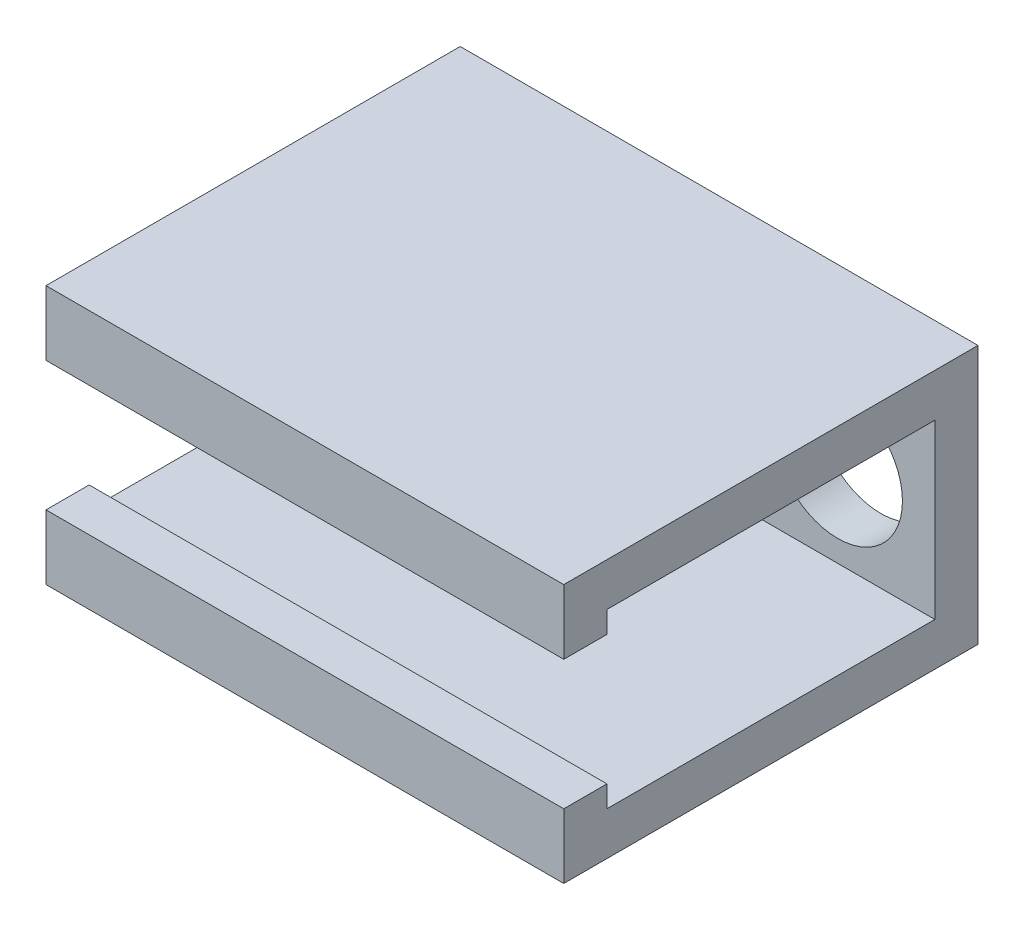
ISO-10303-21;
HEADER;
FILE_DESCRIPTION(('STEP AP214'),'2;1');
FILE_NAME('part.step','',(''),(''),'','','');
FILE_SCHEMA(('AUTOMOTIVE_DESIGN { 1 0 10303 214 1 1 1 1 }'));
ENDSEC;
DATA;
#1=APPLICATION_CONTEXT('core data for automotive mechanical design processes');
#2=APPLICATION_PROTOCOL_DEFINITION('international standard','automotive_design',2000,#1);
#3=PRODUCT_CONTEXT('',#1,'mechanical');
#4=PRODUCT('Part','Part','',(#3));
#5=PRODUCT_RELATED_PRODUCT_CATEGORY('part','',(#4));
#6=PRODUCT_DEFINITION_FORMATION('','',#4);
#7=PRODUCT_DEFINITION_CONTEXT('part definition',#1,'design');
#8=PRODUCT_DEFINITION('design','',#6,#7);
#9=PRODUCT_DEFINITION_SHAPE('','',#8);
#10=(LENGTH_UNIT() NAMED_UNIT(*) SI_UNIT(.MILLI.,.METRE.));
#11=(NAMED_UNIT(*) PLANE_ANGLE_UNIT() SI_UNIT($,.RADIAN.));
#12=(NAMED_UNIT(*) SI_UNIT($,.STERADIAN.) SOLID_ANGLE_UNIT());
#13=UNCERTAINTY_MEASURE_WITH_UNIT(LENGTH_MEASURE(1.E-05),#10,'distance_accuracy_value','');
#14=(GEOMETRIC_REPRESENTATION_CONTEXT(3) GLOBAL_UNCERTAINTY_ASSIGNED_CONTEXT((#13)) GLOBAL_UNIT_ASSIGNED_CONTEXT((#10,
#11,#12)) REPRESENTATION_CONTEXT('',''));
#15=CARTESIAN_POINT('',(0.,0.,0.));
#16=DIRECTION('',(0.,0.,1.));
#17=DIRECTION('',(1.,0.,0.));
#18=AXIS2_PLACEMENT_3D('',#15,#16,#17);
#19=CARTESIAN_POINT('',(60.,0.,-38.));
#20=DIRECTION('',(0.,0.,1.));
#21=DIRECTION('',(1.,0.,0.));
#22=AXIS2_PLACEMENT_3D('',#19,#20,#21);
#23=PLANE('',#22);
#24=CARTESIAN_POINT('',(48.7436129037064,0.,-38.));
#25=DIRECTION('',(0.,0.,1.));
#26=DIRECTION('',(1.,0.,0.));
#27=AXIS2_PLACEMENT_3D('',#24,#25,#26);
#28=CIRCLE('',#27,7.5);
#29=CARTESIAN_POINT('',(56.2436129037064,0.,-38.));
#30=VERTEX_POINT('',#29);
#31=EDGE_CURVE('E157',#30,#30,#28,.T.);
#32=ORIENTED_EDGE('',*,*,#31,.F.);
#33=EDGE_LOOP('',(#32));
#34=FACE_BOUND('',#33,.T.);
#35=DIRECTION('',(0.,1.,0.));
#36=VECTOR('',#35,1.);
#37=CARTESIAN_POINT('',(0.,0.,-38.));
#38=LINE('',#37,#36);
#39=CARTESIAN_POINT('',(0.,-10.,-38.));
#40=VERTEX_POINT('',#39);
#41=CARTESIAN_POINT('',(0.,10.,-38.));
#42=VERTEX_POINT('',#41);
#43=EDGE_CURVE('E153',#40,#42,#38,.T.);
#44=ORIENTED_EDGE('',*,*,#43,.F.);
#45=DIRECTION('',(-1.,0.,0.));
#46=VECTOR('',#45,1.);
#47=CARTESIAN_POINT('',(60.,-10.,-38.));
#48=LINE('',#47,#46);
#49=CARTESIAN_POINT('',(60.,-10.,-38.));
#50=VERTEX_POINT('',#49);
#51=EDGE_CURVE('E11',#50,#40,#48,.T.);
#52=ORIENTED_EDGE('',*,*,#51,.F.);
#53=DIRECTION('',(0.,1.,0.));
#54=VECTOR('',#53,1.);
#55=CARTESIAN_POINT('',(60.,0.,-38.));
#56=LINE('',#55,#54);
#57=CARTESIAN_POINT('',(60.,10.,-38.));
#58=VERTEX_POINT('',#57);
#59=EDGE_CURVE('E184',#50,#58,#56,.T.);
#60=ORIENTED_EDGE('',*,*,#59,.T.);
#61=DIRECTION('',(-1.,0.,0.));
#62=VECTOR('',#61,1.);
#63=CARTESIAN_POINT('',(60.,10.,-38.));
#64=LINE('',#63,#62);
#65=EDGE_CURVE('E97',#58,#42,#64,.T.);
#66=ORIENTED_EDGE('',*,*,#65,.T.);
#67=EDGE_LOOP('',(#44,#52,#60,#66));
#68=FACE_BOUND('',#67,.T.);
#69=ADVANCED_FACE('F35',(#34,#68),#23,.T.);
#70=CARTESIAN_POINT('',(60.,-10.,0.));
#71=DIRECTION('',(0.,1.,0.));
#72=DIRECTION('',(0.,0.,1.));
#73=AXIS2_PLACEMENT_3D('',#70,#71,#72);
#74=PLANE('',#73);
#75=DIRECTION('',(0.,0.,-1.));
#76=VECTOR('',#75,1.);
#77=CARTESIAN_POINT('',(0.,-10.,0.));
#78=LINE('',#77,#76);
#79=CARTESIAN_POINT('',(0.,-10.,0.));
#80=VERTEX_POINT('',#79);
#81=EDGE_CURVE('E156',#80,#40,#78,.T.);
#82=ORIENTED_EDGE('',*,*,#81,.F.);
#83=DIRECTION('',(-1.,0.,0.));
#84=VECTOR('',#83,1.);
#85=CARTESIAN_POINT('',(60.,-10.,0.));
#86=LINE('',#85,#84);
#87=CARTESIAN_POINT('',(60.,-10.,0.));
#88=VERTEX_POINT('',#87);
#89=EDGE_CURVE('E43',#88,#80,#86,.T.);
#90=ORIENTED_EDGE('',*,*,#89,.F.);
#91=DIRECTION('',(0.,0.,-1.));
#92=VECTOR('',#91,1.);
#93=CARTESIAN_POINT('',(60.,-10.,0.));
#94=LINE('',#93,#92);
#95=EDGE_CURVE('E224',#88,#50,#94,.T.);
#96=ORIENTED_EDGE('',*,*,#95,.T.);
#97=ORIENTED_EDGE('',*,*,#51,.T.);
#98=EDGE_LOOP('',(#82,#90,#96,#97));
#99=FACE_BOUND('',#98,.T.);
#100=ADVANCED_FACE('F210',(#99),#74,.T.);
#101=CARTESIAN_POINT('',(60.,0.,0.));
#102=DIRECTION('',(0.,0.,-1.));
#103=DIRECTION('',(0.,1.,0.));
#104=AXIS2_PLACEMENT_3D('',#101,#102,#103);
#105=PLANE('',#104);
#106=DIRECTION('',(0.,-1.,0.));
#107=VECTOR('',#106,1.);
#108=CARTESIAN_POINT('',(0.,0.,0.));
#109=LINE('',#108,#107);
#110=CARTESIAN_POINT('',(0.,-7.5,0.));
#111=VERTEX_POINT('',#110);
#112=EDGE_CURVE('E160',#111,#80,#109,.T.);
#113=ORIENTED_EDGE('',*,*,#112,.F.);
#114=DIRECTION('',(-1.,0.,0.));
#115=VECTOR('',#114,1.);
#116=CARTESIAN_POINT('',(60.,-7.5,0.));
#117=LINE('',#116,#115);
#118=CARTESIAN_POINT('',(60.,-7.5,0.));
#119=VERTEX_POINT('',#118);
#120=EDGE_CURVE('E199',#119,#111,#117,.T.);
#121=ORIENTED_EDGE('',*,*,#120,.F.);
#122=DIRECTION('',(0.,-1.,0.));
#123=VECTOR('',#122,1.);
#124=CARTESIAN_POINT('',(60.,0.,0.));
#125=LINE('',#124,#123);
#126=EDGE_CURVE('E206',#119,#88,#125,.T.);
#127=ORIENTED_EDGE('',*,*,#126,.T.);
#128=ORIENTED_EDGE('',*,*,#89,.T.);
#129=EDGE_LOOP('',(#113,#121,#127,#128));
#130=FACE_BOUND('',#129,.T.);
#131=ADVANCED_FACE('F204',(#130),#105,.T.);
#132=CARTESIAN_POINT('',(60.,-7.5,0.));
#133=DIRECTION('',(0.,-1.,0.));
#134=DIRECTION('',(0.,0.,-1.));
#135=AXIS2_PLACEMENT_3D('',#132,#133,#134);
#136=PLANE('',#135);
#137=DIRECTION('',(0.,0.,1.));
#138=VECTOR('',#137,1.);
#139=CARTESIAN_POINT('',(0.,-7.5,0.));
#140=LINE('',#139,#138);
#141=CARTESIAN_POINT('',(0.,-7.5,5.));
#142=VERTEX_POINT('',#141);
#143=EDGE_CURVE('E163',#111,#142,#140,.T.);
#144=ORIENTED_EDGE('',*,*,#143,.T.);
#145=DIRECTION('',(-1.,0.,0.));
#146=VECTOR('',#145,1.);
#147=CARTESIAN_POINT('',(60.,-7.5,5.));
#148=LINE('',#147,#146);
#149=CARTESIAN_POINT('',(60.,-7.5,5.));
#150=VERTEX_POINT('',#149);
#151=EDGE_CURVE('E197',#150,#142,#148,.T.);
#152=ORIENTED_EDGE('',*,*,#151,.F.);
#153=DIRECTION('',(0.,0.,1.));
#154=VECTOR('',#153,1.);
#155=CARTESIAN_POINT('',(60.,-7.5,0.));
#156=LINE('',#155,#154);
#157=EDGE_CURVE('E221',#119,#150,#156,.T.);
#158=ORIENTED_EDGE('',*,*,#157,.F.);
#159=ORIENTED_EDGE('',*,*,#120,.T.);
#160=EDGE_LOOP('',(#144,#152,#158,#159));
#161=FACE_BOUND('',#160,.T.);
#162=ADVANCED_FACE('F218',(#161),#136,.F.);
#163=CARTESIAN_POINT('',(60.,0.,5.));
#164=DIRECTION('',(0.,0.,-1.));
#165=DIRECTION('',(-1.,0.,0.));
#166=AXIS2_PLACEMENT_3D('',#163,#164,#165);
#167=PLANE('',#166);
#168=DIRECTION('',(0.,-1.,0.));
#169=VECTOR('',#168,1.);
#170=CARTESIAN_POINT('',(0.,0.,5.));
#171=LINE('',#170,#169);
#172=CARTESIAN_POINT('',(0.,-15.,5.));
#173=VERTEX_POINT('',#172);
#174=EDGE_CURVE('E166',#142,#173,#171,.T.);
#175=ORIENTED_EDGE('',*,*,#174,.T.);
#176=DIRECTION('',(-1.,0.,0.));
#177=VECTOR('',#176,1.);
#178=CARTESIAN_POINT('',(60.,-15.,5.));
#179=LINE('',#178,#177);
#180=CARTESIAN_POINT('',(60.,-15.,5.));
#181=VERTEX_POINT('',#180);
#182=EDGE_CURVE('E194',#181,#173,#179,.T.);
#183=ORIENTED_EDGE('',*,*,#182,.F.);
#184=DIRECTION('',(0.,-1.,0.));
#185=VECTOR('',#184,1.);
#186=CARTESIAN_POINT('',(60.,0.,5.));
#187=LINE('',#186,#185);
#188=EDGE_CURVE('E222',#150,#181,#187,.T.);
#189=ORIENTED_EDGE('',*,*,#188,.F.);
#190=ORIENTED_EDGE('',*,*,#151,.T.);
#191=EDGE_LOOP('',(#175,#183,#189,#190));
#192=FACE_BOUND('',#191,.T.);
#193=ADVANCED_FACE('F265',(#192),#167,.F.);
#194=CARTESIAN_POINT('',(60.,-15.,0.));
#195=DIRECTION('',(0.,1.,0.));
#196=DIRECTION('',(0.,0.,1.));
#197=AXIS2_PLACEMENT_3D('',#194,#195,#196);
#198=PLANE('',#197);
#199=DIRECTION('',(0.,0.,-1.));
#200=VECTOR('',#199,1.);
#201=CARTESIAN_POINT('',(0.,-15.,0.));
#202=LINE('',#201,#200);
#203=CARTESIAN_POINT('',(0.,-15.,-43.));
#204=VERTEX_POINT('',#203);
#205=EDGE_CURVE('E168',#173,#204,#202,.T.);
#206=ORIENTED_EDGE('',*,*,#205,.T.);
#207=DIRECTION('',(-1.,0.,0.));
#208=VECTOR('',#207,1.);
#209=CARTESIAN_POINT('',(60.,-15.,-43.));
#210=LINE('',#209,#208);
#211=CARTESIAN_POINT('',(60.,-15.,-43.));
#212=VERTEX_POINT('',#211);
#213=EDGE_CURVE('E192',#212,#204,#210,.T.);
#214=ORIENTED_EDGE('',*,*,#213,.F.);
#215=DIRECTION('',(0.,0.,-1.));
#216=VECTOR('',#215,1.);
#217=CARTESIAN_POINT('',(60.,-15.,0.));
#218=LINE('',#217,#216);
#219=EDGE_CURVE('E230',#181,#212,#218,.T.);
#220=ORIENTED_EDGE('',*,*,#219,.F.);
#221=ORIENTED_EDGE('',*,*,#182,.T.);
#222=EDGE_LOOP('',(#206,#214,#220,#221));
#223=FACE_BOUND('',#222,.T.);
#224=ADVANCED_FACE('F258',(#223),#198,.F.);
#225=CARTESIAN_POINT('',(60.,0.,-43.));
#226=DIRECTION('',(0.,0.,-1.));
#227=DIRECTION('',(-1.,0.,0.));
#228=AXIS2_PLACEMENT_3D('',#225,#226,#227);
#229=PLANE('',#228);
#230=CARTESIAN_POINT('',(48.7436129037064,0.,-43.));
#231=DIRECTION('',(0.,0.,-1.));
#232=DIRECTION('',(-1.,0.,0.));
#233=AXIS2_PLACEMENT_3D('',#230,#231,#232);
#234=CIRCLE('',#233,7.5);
#235=CARTESIAN_POINT('',(41.2436129037064,0.,-43.));
#236=VERTEX_POINT('',#235);
#237=EDGE_CURVE('E249',#236,#236,#234,.T.);
#238=ORIENTED_EDGE('',*,*,#237,.F.);
#239=EDGE_LOOP('',(#238));
#240=FACE_BOUND('',#239,.T.);
#241=DIRECTION('',(0.,-1.,0.));
#242=VECTOR('',#241,1.);
#243=CARTESIAN_POINT('',(0.,0.,-43.));
#244=LINE('',#243,#242);
#245=CARTESIAN_POINT('',(0.,15.,-43.));
#246=VERTEX_POINT('',#245);
#247=EDGE_CURVE('E171',#246,#204,#244,.T.);
#248=ORIENTED_EDGE('',*,*,#247,.F.);
#249=DIRECTION('',(-1.,0.,0.));
#250=VECTOR('',#249,1.);
#251=CARTESIAN_POINT('',(60.,15.,-43.));
#252=LINE('',#251,#250);
#253=CARTESIAN_POINT('',(60.,15.,-43.));
#254=VERTEX_POINT('',#253);
#255=EDGE_CURVE('E190',#254,#246,#252,.T.);
#256=ORIENTED_EDGE('',*,*,#255,.F.);
#257=DIRECTION('',(0.,-1.,0.));
#258=VECTOR('',#257,1.);
#259=CARTESIAN_POINT('',(60.,0.,-43.));
#260=LINE('',#259,#258);
#261=EDGE_CURVE('E232',#254,#212,#260,.T.);
#262=ORIENTED_EDGE('',*,*,#261,.T.);
#263=ORIENTED_EDGE('',*,*,#213,.T.);
#264=EDGE_LOOP('',(#248,#256,#262,#263));
#265=FACE_BOUND('',#264,.T.);
#266=ADVANCED_FACE('F255',(#240,#265),#229,.T.);
#267=CARTESIAN_POINT('',(60.,15.,0.));
#268=DIRECTION('',(0.,1.,0.));
#269=DIRECTION('',(0.,0.,1.));
#270=AXIS2_PLACEMENT_3D('',#267,#268,#269);
#271=PLANE('',#270);
#272=DIRECTION('',(0.,0.,-1.));
#273=VECTOR('',#272,1.);
#274=CARTESIAN_POINT('',(0.,15.,0.));
#275=LINE('',#274,#273);
#276=CARTESIAN_POINT('',(0.,15.,5.));
#277=VERTEX_POINT('',#276);
#278=EDGE_CURVE('E174',#277,#246,#275,.T.);
#279=ORIENTED_EDGE('',*,*,#278,.F.);
#280=DIRECTION('',(-1.,0.,0.));
#281=VECTOR('',#280,1.);
#282=CARTESIAN_POINT('',(60.,15.,5.));
#283=LINE('',#282,#281);
#284=CARTESIAN_POINT('',(60.,15.,5.));
#285=VERTEX_POINT('',#284);
#286=EDGE_CURVE('E188',#285,#277,#283,.T.);
#287=ORIENTED_EDGE('',*,*,#286,.F.);
#288=DIRECTION('',(0.,0.,-1.));
#289=VECTOR('',#288,1.);
#290=CARTESIAN_POINT('',(60.,15.,0.));
#291=LINE('',#290,#289);
#292=EDGE_CURVE('E148',#285,#254,#291,.T.);
#293=ORIENTED_EDGE('',*,*,#292,.T.);
#294=ORIENTED_EDGE('',*,*,#255,.T.);
#295=EDGE_LOOP('',(#279,#287,#293,#294));
#296=FACE_BOUND('',#295,.T.);
#297=ADVANCED_FACE('F237',(#296),#271,.T.);
#298=CARTESIAN_POINT('',(60.,0.,5.));
#299=DIRECTION('',(0.,0.,1.));
#300=DIRECTION('',(1.,0.,0.));
#301=AXIS2_PLACEMENT_3D('',#298,#299,#300);
#302=PLANE('',#301);
#303=DIRECTION('',(0.,1.,0.));
#304=VECTOR('',#303,1.);
#305=CARTESIAN_POINT('',(0.,0.,5.));
#306=LINE('',#305,#304);
#307=CARTESIAN_POINT('',(0.,7.5,5.));
#308=VERTEX_POINT('',#307);
#309=EDGE_CURVE('E177',#308,#277,#306,.T.);
#310=ORIENTED_EDGE('',*,*,#309,.F.);
#311=DIRECTION('',(-1.,0.,0.));
#312=VECTOR('',#311,1.);
#313=CARTESIAN_POINT('',(60.,7.5,5.));
#314=LINE('',#313,#312);
#315=CARTESIAN_POINT('',(60.,7.5,5.));
#316=VERTEX_POINT('',#315);
#317=EDGE_CURVE('E136',#316,#308,#314,.T.);
#318=ORIENTED_EDGE('',*,*,#317,.F.);
#319=DIRECTION('',(0.,1.,0.));
#320=VECTOR('',#319,1.);
#321=CARTESIAN_POINT('',(60.,0.,5.));
#322=LINE('',#321,#320);
#323=EDGE_CURVE('E146',#316,#285,#322,.T.);
#324=ORIENTED_EDGE('',*,*,#323,.T.);
#325=ORIENTED_EDGE('',*,*,#286,.T.);
#326=EDGE_LOOP('',(#310,#318,#324,#325));
#327=FACE_BOUND('',#326,.T.);
#328=ADVANCED_FACE('F242',(#327),#302,.T.);
#329=CARTESIAN_POINT('',(60.,7.5,0.));
#330=DIRECTION('',(0.,-1.,0.));
#331=DIRECTION('',(0.,0.,-1.));
#332=AXIS2_PLACEMENT_3D('',#329,#330,#331);
#333=PLANE('',#332);
#334=DIRECTION('',(0.,0.,1.));
#335=VECTOR('',#334,1.);
#336=CARTESIAN_POINT('',(0.,7.5,0.));
#337=LINE('',#336,#335);
#338=CARTESIAN_POINT('',(0.,7.5,0.));
#339=VERTEX_POINT('',#338);
#340=EDGE_CURVE('E135',#339,#308,#337,.T.);
#341=ORIENTED_EDGE('',*,*,#340,.F.);
#342=DIRECTION('',(-1.,0.,0.));
#343=VECTOR('',#342,1.);
#344=CARTESIAN_POINT('',(60.,7.5,0.));
#345=LINE('',#344,#343);
#346=CARTESIAN_POINT('',(60.,7.5,0.));
#347=VERTEX_POINT('',#346);
#348=EDGE_CURVE('E129',#347,#339,#345,.T.);
#349=ORIENTED_EDGE('',*,*,#348,.F.);
#350=DIRECTION('',(0.,0.,1.));
#351=VECTOR('',#350,1.);
#352=CARTESIAN_POINT('',(60.,7.5,0.));
#353=LINE('',#352,#351);
#354=EDGE_CURVE('E133',#347,#316,#353,.T.);
#355=ORIENTED_EDGE('',*,*,#354,.T.);
#356=ORIENTED_EDGE('',*,*,#317,.T.);
#357=EDGE_LOOP('',(#341,#349,#355,#356));
#358=FACE_BOUND('',#357,.T.);
#359=ADVANCED_FACE('F131',(#358),#333,.T.);
#360=CARTESIAN_POINT('',(60.,0.,0.));
#361=DIRECTION('',(0.,0.,1.));
#362=DIRECTION('',(0.,-1.,0.));
#363=AXIS2_PLACEMENT_3D('',#360,#361,#362);
#364=PLANE('',#363);
#365=DIRECTION('',(0.,1.,0.));
#366=VECTOR('',#365,1.);
#367=CARTESIAN_POINT('',(0.,0.,0.));
#368=LINE('',#367,#366);
#369=CARTESIAN_POINT('',(0.,10.,0.));
#370=VERTEX_POINT('',#369);
#371=EDGE_CURVE('E90',#339,#370,#368,.T.);
#372=ORIENTED_EDGE('',*,*,#371,.T.);
#373=DIRECTION('',(-1.,0.,0.));
#374=VECTOR('',#373,1.);
#375=CARTESIAN_POINT('',(60.,10.,0.));
#376=LINE('',#375,#374);
#377=CARTESIAN_POINT('',(60.,10.,0.));
#378=VERTEX_POINT('',#377);
#379=EDGE_CURVE('E137',#378,#370,#376,.T.);
#380=ORIENTED_EDGE('',*,*,#379,.F.);
#381=DIRECTION('',(0.,1.,0.));
#382=VECTOR('',#381,1.);
#383=CARTESIAN_POINT('',(60.,0.,0.));
#384=LINE('',#383,#382);
#385=EDGE_CURVE('E139',#347,#378,#384,.T.);
#386=ORIENTED_EDGE('',*,*,#385,.F.);
#387=ORIENTED_EDGE('',*,*,#348,.T.);
#388=EDGE_LOOP('',(#372,#380,#386,#387));
#389=FACE_BOUND('',#388,.T.);
#390=ADVANCED_FACE('F140',(#389),#364,.F.);
#391=CARTESIAN_POINT('',(60.,10.,0.));
#392=DIRECTION('',(0.,1.,0.));
#393=DIRECTION('',(0.,0.,1.));
#394=AXIS2_PLACEMENT_3D('',#391,#392,#393);
#395=PLANE('',#394);
#396=DIRECTION('',(0.,0.,-1.));
#397=VECTOR('',#396,1.);
#398=CARTESIAN_POINT('',(0.,10.,0.));
#399=LINE('',#398,#397);
#400=EDGE_CURVE('E182',#370,#42,#399,.T.);
#401=ORIENTED_EDGE('',*,*,#400,.T.);
#402=ORIENTED_EDGE('',*,*,#65,.F.);
#403=DIRECTION('',(0.,0.,-1.));
#404=VECTOR('',#403,1.);
#405=CARTESIAN_POINT('',(60.,10.,0.));
#406=LINE('',#405,#404);
#407=EDGE_CURVE('E51',#378,#58,#406,.T.);
#408=ORIENTED_EDGE('',*,*,#407,.F.);
#409=ORIENTED_EDGE('',*,*,#379,.T.);
#410=EDGE_LOOP('',(#401,#402,#408,#409));
#411=FACE_BOUND('',#410,.T.);
#412=ADVANCED_FACE('F245',(#411),#395,.F.);
#413=CARTESIAN_POINT('',(60.,0.,0.));
#414=DIRECTION('',(1.,0.,0.));
#415=DIRECTION('',(0.,0.,-1.));
#416=AXIS2_PLACEMENT_3D('',#413,#414,#415);
#417=PLANE('',#416);
#418=ORIENTED_EDGE('',*,*,#59,.F.);
#419=ORIENTED_EDGE('',*,*,#95,.F.);
#420=ORIENTED_EDGE('',*,*,#126,.F.);
#421=ORIENTED_EDGE('',*,*,#157,.T.);
#422=ORIENTED_EDGE('',*,*,#188,.T.);
#423=ORIENTED_EDGE('',*,*,#219,.T.);
#424=ORIENTED_EDGE('',*,*,#261,.F.);
#425=ORIENTED_EDGE('',*,*,#292,.F.);
#426=ORIENTED_EDGE('',*,*,#323,.F.);
#427=ORIENTED_EDGE('',*,*,#354,.F.);
#428=ORIENTED_EDGE('',*,*,#385,.T.);
#429=ORIENTED_EDGE('',*,*,#407,.T.);
#430=EDGE_LOOP('',(#418,#419,#420,#421,#422,#423,#424,#425,#426,#427,#428,#429));
#431=FACE_BOUND('',#430,.T.);
#432=ADVANCED_FACE('F143',(#431),#417,.T.);
#433=CARTESIAN_POINT('',(0.,0.,0.));
#434=DIRECTION('',(1.,0.,0.));
#435=DIRECTION('',(0.,0.,-1.));
#436=AXIS2_PLACEMENT_3D('',#433,#434,#435);
#437=PLANE('',#436);
#438=ORIENTED_EDGE('',*,*,#43,.T.);
#439=ORIENTED_EDGE('',*,*,#400,.F.);
#440=ORIENTED_EDGE('',*,*,#371,.F.);
#441=ORIENTED_EDGE('',*,*,#340,.T.);
#442=ORIENTED_EDGE('',*,*,#309,.T.);
#443=ORIENTED_EDGE('',*,*,#278,.T.);
#444=ORIENTED_EDGE('',*,*,#247,.T.);
#445=ORIENTED_EDGE('',*,*,#205,.F.);
#446=ORIENTED_EDGE('',*,*,#174,.F.);
#447=ORIENTED_EDGE('',*,*,#143,.F.);
#448=ORIENTED_EDGE('',*,*,#112,.T.);
#449=ORIENTED_EDGE('',*,*,#81,.T.);
#450=EDGE_LOOP('',(#438,#439,#440,#441,#442,#443,#444,#445,#446,#447,#448,#449));
#451=FACE_BOUND('',#450,.T.);
#452=ADVANCED_FACE('F213',(#451),#437,.F.);
#453=CARTESIAN_POINT('',(48.7436129037064,0.,5.));
#454=DIRECTION('',(0.,0.,-1.));
#455=DIRECTION('',(-1.,0.,0.));
#456=AXIS2_PLACEMENT_3D('',#453,#454,#455);
#457=CYLINDRICAL_SURFACE('',#456,7.5);
#458=ORIENTED_EDGE('',*,*,#31,.T.);
#459=EDGE_LOOP('',(#458));
#460=FACE_BOUND('',#459,.T.);
#461=ORIENTED_EDGE('',*,*,#237,.T.);
#462=EDGE_LOOP('',(#461));
#463=FACE_BOUND('',#462,.T.);
#464=ADVANCED_FACE('F253',(#460,#463),#457,.F.);
#465=CLOSED_SHELL('',(#69,#100,#131,#162,#193,#224,#266,#297,#328,#359,#390,#412,#432,#452,#464));
#466=MANIFOLD_SOLID_BREP('B2',#465);
#467=ADVANCED_BREP_SHAPE_REPRESENTATION('',(#18,#466),#14);
#468=SHAPE_DEFINITION_REPRESENTATION(#9,#467);
ENDSEC;
END-ISO-10303-21;
